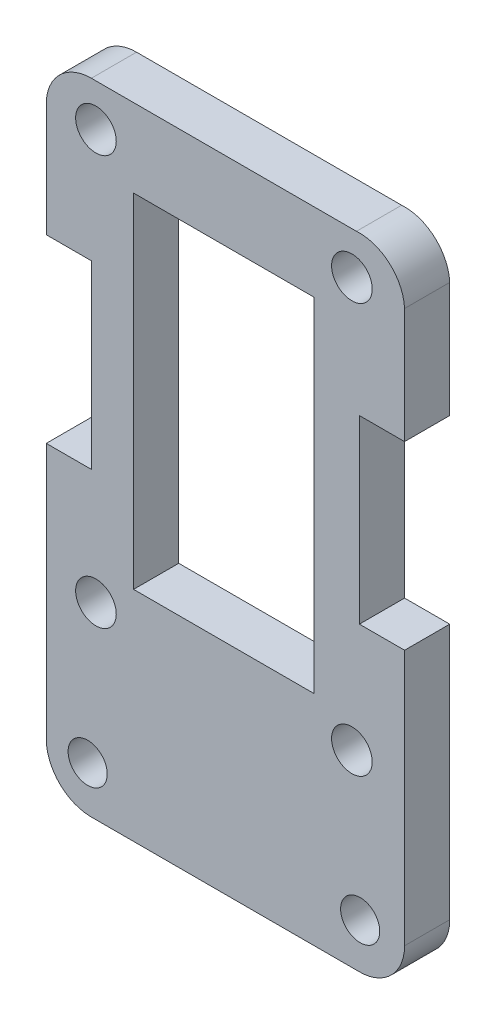
ISO-10303-21;
HEADER;
FILE_DESCRIPTION(('STEP AP214'),'2;1');
FILE_NAME('part.step','',(''),(''),'','','');
FILE_SCHEMA(('AUTOMOTIVE_DESIGN { 1 0 10303 214 1 1 1 1 }'));
ENDSEC;
DATA;
#1=APPLICATION_CONTEXT('core data for automotive mechanical design processes');
#2=APPLICATION_PROTOCOL_DEFINITION('international standard','automotive_design',2000,#1);
#3=PRODUCT_CONTEXT('',#1,'mechanical');
#4=PRODUCT('Part','Part','',(#3));
#5=PRODUCT_RELATED_PRODUCT_CATEGORY('part','',(#4));
#6=PRODUCT_DEFINITION_FORMATION('','',#4);
#7=PRODUCT_DEFINITION_CONTEXT('part definition',#1,'design');
#8=PRODUCT_DEFINITION('design','',#6,#7);
#9=PRODUCT_DEFINITION_SHAPE('','',#8);
#10=(LENGTH_UNIT() NAMED_UNIT(*) SI_UNIT(.MILLI.,.METRE.));
#11=(NAMED_UNIT(*) PLANE_ANGLE_UNIT() SI_UNIT($,.RADIAN.));
#12=(NAMED_UNIT(*) SI_UNIT($,.STERADIAN.) SOLID_ANGLE_UNIT());
#13=UNCERTAINTY_MEASURE_WITH_UNIT(LENGTH_MEASURE(1.E-05),#10,'distance_accuracy_value','');
#14=(GEOMETRIC_REPRESENTATION_CONTEXT(3) GLOBAL_UNCERTAINTY_ASSIGNED_CONTEXT((#13)) GLOBAL_UNIT_ASSIGNED_CONTEXT((#10,
#11,#12)) REPRESENTATION_CONTEXT('',''));
#15=CARTESIAN_POINT('',(0.,0.,0.));
#16=DIRECTION('',(0.,0.,1.));
#17=DIRECTION('',(1.,0.,0.));
#18=AXIS2_PLACEMENT_3D('',#15,#16,#17);
#19=CARTESIAN_POINT('',(58.6723620529699,60.5131167079834,3.));
#20=DIRECTION('',(0.,0.,1.));
#21=DIRECTION('',(1.,0.,0.));
#22=AXIS2_PLACEMENT_3D('',#19,#20,#21);
#23=PLANE('',#22);
#24=CARTESIAN_POINT('',(40.6173019415378,24.0039718277045,3.));
#25=DIRECTION('',(0.,0.,1.));
#26=DIRECTION('',(1.,0.,0.));
#27=AXIS2_PLACEMENT_3D('',#24,#25,#26);
#28=CIRCLE('',#27,1.30010409029223);
#29=CARTESIAN_POINT('',(41.91740603183,24.0039718277045,3.));
#30=VERTEX_POINT('',#29);
#31=EDGE_CURVE('E213',#30,#30,#28,.T.);
#32=ORIENTED_EDGE('',*,*,#31,.F.);
#33=EDGE_LOOP('',(#32));
#34=FACE_BOUND('',#33,.T.);
#35=CARTESIAN_POINT('',(41.1672459750652,33.5047324908659,3.));
#36=DIRECTION('',(0.,0.,1.));
#37=DIRECTION('',(1.,0.,0.));
#38=AXIS2_PLACEMENT_3D('',#35,#36,#37);
#39=CIRCLE('',#38,1.35010809376501);
#40=CARTESIAN_POINT('',(42.5173540688302,33.5047324908659,3.));
#41=VERTEX_POINT('',#40);
#42=EDGE_CURVE('E225',#41,#41,#39,.T.);
#43=ORIENTED_EDGE('',*,*,#42,.F.);
#44=EDGE_LOOP('',(#43));
#45=FACE_BOUND('',#44,.T.);
#46=CARTESIAN_POINT('',(41.1672459750652,60.7069103800571,3.));
#47=DIRECTION('',(0.,0.,1.));
#48=DIRECTION('',(1.,0.,0.));
#49=AXIS2_PLACEMENT_3D('',#46,#47,#48);
#50=CIRCLE('',#49,1.35010809376501);
#51=CARTESIAN_POINT('',(42.5173540688302,60.7069103800571,3.));
#52=VERTEX_POINT('',#51);
#53=EDGE_CURVE('E237',#52,#52,#50,.T.);
#54=ORIENTED_EDGE('',*,*,#53,.F.);
#55=EDGE_LOOP('',(#54));
#56=FACE_BOUND('',#55,.T.);
#57=CARTESIAN_POINT('',(58.6723620529699,60.5131167079834,3.));
#58=DIRECTION('',(0.,0.,1.));
#59=DIRECTION('',(1.,0.,0.));
#60=AXIS2_PLACEMENT_3D('',#57,#58,#59);
#61=CIRCLE('',#60,3.00012950662675);
#62=CARTESIAN_POINT('',(61.6686971945409,60.6639569410741,3.));
#63=VERTEX_POINT('',#62);
#64=CARTESIAN_POINT('',(58.4724383861315,63.5065775117973,3.));
#65=VERTEX_POINT('',#64);
#66=EDGE_CURVE('E243',#63,#65,#61,.T.);
#67=ORIENTED_EDGE('',*,*,#66,.T.);
#68=DIRECTION('',(-1.,0.,0.));
#69=VECTOR('',#68,1.);
#70=CARTESIAN_POINT('',(40.8627941372652,63.5065775117973,3.));
#71=LINE('',#70,#69);
#72=CARTESIAN_POINT('',(40.8627941372652,63.5065775117973,3.));
#73=VERTEX_POINT('',#72);
#74=EDGE_CURVE('E246',#65,#73,#71,.T.);
#75=ORIENTED_EDGE('',*,*,#74,.T.);
#76=CARTESIAN_POINT('',(40.8627941372613,60.5064480051708,3.));
#77=DIRECTION('',(0.,0.,1.));
#78=DIRECTION('',(1.,0.,0.));
#79=AXIS2_PLACEMENT_3D('',#76,#77,#78);
#80=CIRCLE('',#79,3.00012950662654);
#81=CARTESIAN_POINT('',(37.8667755346662,60.6634498823416,3.));
#82=VERTEX_POINT('',#81);
#83=EDGE_CURVE('E249',#73,#82,#80,.T.);
#84=ORIENTED_EDGE('',*,*,#83,.T.);
#85=DIRECTION('',(0.,-1.,0.));
#86=VECTOR('',#85,1.);
#87=CARTESIAN_POINT('',(37.8667755346662,53.0047759490466,3.));
#88=LINE('',#87,#86);
#89=CARTESIAN_POINT('',(37.8667755346662,53.0047759490466,3.));
#90=VERTEX_POINT('',#89);
#91=EDGE_CURVE('E251',#82,#90,#88,.T.);
#92=ORIENTED_EDGE('',*,*,#91,.T.);
#93=DIRECTION('',(1.,0.,0.));
#94=VECTOR('',#93,1.);
#95=CARTESIAN_POINT('',(37.8667755346662,53.0047759490466,3.));
#96=LINE('',#95,#94);
#97=CARTESIAN_POINT('',(40.8670157430328,53.0047759490466,3.));
#98=VERTEX_POINT('',#97);
#99=EDGE_CURVE('E253',#90,#98,#96,.T.);
#100=ORIENTED_EDGE('',*,*,#99,.T.);
#101=DIRECTION('',(0.,-1.,0.));
#102=VECTOR('',#101,1.);
#103=CARTESIAN_POINT('',(40.8670157430328,53.0047759490466,3.));
#104=LINE('',#103,#102);
#105=CARTESIAN_POINT('',(40.8670157430328,41.0047759490469,3.));
#106=VERTEX_POINT('',#105);
#107=EDGE_CURVE('E255',#98,#106,#104,.T.);
#108=ORIENTED_EDGE('',*,*,#107,.T.);
#109=DIRECTION('',(-1.,0.,0.));
#110=VECTOR('',#109,1.);
#111=CARTESIAN_POINT('',(40.8670157430328,41.0047759490469,3.));
#112=LINE('',#111,#110);
#113=CARTESIAN_POINT('',(37.8667755346662,41.0047759490469,3.));
#114=VERTEX_POINT('',#113);
#115=EDGE_CURVE('E257',#106,#114,#112,.T.);
#116=ORIENTED_EDGE('',*,*,#115,.T.);
#117=DIRECTION('',(0.,-1.,0.));
#118=VECTOR('',#117,1.);
#119=CARTESIAN_POINT('',(37.8667755346662,41.0047759490469,3.));
#120=LINE('',#119,#118);
#121=CARTESIAN_POINT('',(37.8667755346662,24.0034147683111,3.));
#122=VERTEX_POINT('',#121);
#123=EDGE_CURVE('E259',#114,#122,#120,.T.);
#124=ORIENTED_EDGE('',*,*,#123,.T.);
#125=CARTESIAN_POINT('',(40.8670851997447,24.003484225014,3.));
#126=DIRECTION('',(0.,0.,1.));
#127=DIRECTION('',(1.,0.,0.));
#128=AXIS2_PLACEMENT_3D('',#125,#126,#127);
#129=CIRCLE('',#128,3.00030966588246);
#130=CARTESIAN_POINT('',(40.7670519528112,21.0048426257735,3.));
#131=VERTEX_POINT('',#130);
#132=EDGE_CURVE('E261',#122,#131,#129,.T.);
#133=ORIENTED_EDGE('',*,*,#132,.T.);
#134=DIRECTION('',(1.,0.,0.));
#135=VECTOR('',#134,1.);
#136=CARTESIAN_POINT('',(40.7670519528112,21.0048426257735,3.));
#137=LINE('',#136,#135);
#138=CARTESIAN_POINT('',(58.5681805705856,21.0048426257735,3.));
#139=VERTEX_POINT('',#138);
#140=EDGE_CURVE('E263',#131,#139,#137,.T.);
#141=ORIENTED_EDGE('',*,*,#140,.T.);
#142=CARTESIAN_POINT('',(58.6682167848662,24.003654976669,3.));
#143=DIRECTION('',(0.,0.,1.));
#144=DIRECTION('',(1.,0.,0.));
#145=AXIS2_PLACEMENT_3D('',#142,#143,#144);
#146=CIRCLE('',#145,3.00048042154096);
#147=CARTESIAN_POINT('',(61.6686971945409,24.0039218270347,3.));
#148=VERTEX_POINT('',#147);
#149=EDGE_CURVE('E265',#139,#148,#146,.T.);
#150=ORIENTED_EDGE('',*,*,#149,.T.);
#151=DIRECTION('',(0.,1.,0.));
#152=VECTOR('',#151,1.);
#153=CARTESIAN_POINT('',(61.6686971945409,24.0039218270347,3.));
#154=LINE('',#153,#152);
#155=CARTESIAN_POINT('',(61.6686971945409,41.0047759490469,3.));
#156=VERTEX_POINT('',#155);
#157=EDGE_CURVE('E267',#148,#156,#154,.T.);
#158=ORIENTED_EDGE('',*,*,#157,.T.);
#159=DIRECTION('',(-1.,0.,0.));
#160=VECTOR('',#159,1.);
#161=CARTESIAN_POINT('',(58.6686971945409,41.0047759490469,3.));
#162=LINE('',#161,#160);
#163=CARTESIAN_POINT('',(58.6686971945409,41.0047759490469,3.));
#164=VERTEX_POINT('',#163);
#165=EDGE_CURVE('E269',#156,#164,#162,.T.);
#166=ORIENTED_EDGE('',*,*,#165,.T.);
#167=DIRECTION('',(0.,1.,0.));
#168=VECTOR('',#167,1.);
#169=CARTESIAN_POINT('',(58.6686971945409,53.0047759490466,3.));
#170=LINE('',#169,#168);
#171=CARTESIAN_POINT('',(58.6686971945409,53.0047759490466,3.));
#172=VERTEX_POINT('',#171);
#173=EDGE_CURVE('E271',#164,#172,#170,.T.);
#174=ORIENTED_EDGE('',*,*,#173,.T.);
#175=DIRECTION('',(1.,0.,0.));
#176=VECTOR('',#175,1.);
#177=CARTESIAN_POINT('',(61.6686971945409,53.0047759490466,3.));
#178=LINE('',#177,#176);
#179=CARTESIAN_POINT('',(61.6686971945409,53.0047759490466,3.));
#180=VERTEX_POINT('',#179);
#181=EDGE_CURVE('E273',#172,#180,#178,.T.);
#182=ORIENTED_EDGE('',*,*,#181,.T.);
#183=DIRECTION('',(0.,1.,0.));
#184=VECTOR('',#183,1.);
#185=CARTESIAN_POINT('',(61.6686971945409,53.0047759490466,3.));
#186=LINE('',#185,#184);
#187=EDGE_CURVE('E275',#180,#63,#186,.T.);
#188=ORIENTED_EDGE('',*,*,#187,.T.);
#189=EDGE_LOOP('',(#67,#75,#84,#92,#100,#108,#116,#124,#133,#141,#150,#158,#166,#174,#182,#188));
#190=FACE_BOUND('',#189,.T.);
#191=CARTESIAN_POINT('',(58.1686071558098,60.7069103800571,3.));
#192=DIRECTION('',(0.,0.,1.));
#193=DIRECTION('',(1.,0.,0.));
#194=AXIS2_PLACEMENT_3D('',#191,#192,#193);
#195=CIRCLE('',#194,1.35010809376501);
#196=CARTESIAN_POINT('',(59.5187152495748,60.7069103800571,3.));
#197=VERTEX_POINT('',#196);
#198=EDGE_CURVE('E231',#197,#197,#195,.T.);
#199=ORIENTED_EDGE('',*,*,#198,.F.);
#200=EDGE_LOOP('',(#199));
#201=FACE_BOUND('',#200,.T.);
#202=CARTESIAN_POINT('',(58.1686071558097,33.5047324908659,3.));
#203=DIRECTION('',(0.,0.,1.));
#204=DIRECTION('',(1.,0.,0.));
#205=AXIS2_PLACEMENT_3D('',#202,#203,#204);
#206=CIRCLE('',#205,1.35010809376501);
#207=CARTESIAN_POINT('',(59.5187152495747,33.5047324908659,3.));
#208=VERTEX_POINT('',#207);
#209=EDGE_CURVE('E219',#208,#208,#206,.T.);
#210=ORIENTED_EDGE('',*,*,#209,.F.);
#211=EDGE_LOOP('',(#210));
#212=FACE_BOUND('',#211,.T.);
#213=CARTESIAN_POINT('',(58.7187511986834,24.0039718277045,3.));
#214=DIRECTION('',(0.,0.,1.));
#215=DIRECTION('',(1.,0.,0.));
#216=AXIS2_PLACEMENT_3D('',#213,#214,#215);
#217=CIRCLE('',#216,1.30010409029223);
#218=CARTESIAN_POINT('',(60.0188552889756,24.0039718277045,3.));
#219=VERTEX_POINT('',#218);
#220=EDGE_CURVE('E207',#219,#219,#217,.T.);
#221=ORIENTED_EDGE('',*,*,#220,.F.);
#222=EDGE_LOOP('',(#221));
#223=FACE_BOUND('',#222,.T.);
#224=DIRECTION('',(0.,-1.,0.));
#225=VECTOR('',#224,1.);
#226=CARTESIAN_POINT('',(43.667135844965,58.3048426257735,3.));
#227=LINE('',#226,#225);
#228=CARTESIAN_POINT('',(43.667135844965,58.3048426257735,3.));
#229=VERTEX_POINT('',#228);
#230=CARTESIAN_POINT('',(43.667135844965,35.5048426257735,3.));
#231=VERTEX_POINT('',#230);
#232=EDGE_CURVE('E179',#229,#231,#227,.T.);
#233=ORIENTED_EDGE('',*,*,#232,.F.);
#234=DIRECTION('',(-1.,0.,0.));
#235=VECTOR('',#234,1.);
#236=CARTESIAN_POINT('',(55.6680966784318,58.3048426257735,3.));
#237=LINE('',#236,#235);
#238=CARTESIAN_POINT('',(55.6680966784318,58.3048426257735,3.));
#239=VERTEX_POINT('',#238);
#240=EDGE_CURVE('E171',#239,#229,#237,.T.);
#241=ORIENTED_EDGE('',*,*,#240,.F.);
#242=DIRECTION('',(0.,1.,0.));
#243=VECTOR('',#242,1.);
#244=CARTESIAN_POINT('',(55.6680966784318,58.3048426257735,3.));
#245=LINE('',#244,#243);
#246=CARTESIAN_POINT('',(55.6680966784318,35.5048426257735,3.));
#247=VERTEX_POINT('',#246);
#248=EDGE_CURVE('E193',#247,#239,#245,.T.);
#249=ORIENTED_EDGE('',*,*,#248,.F.);
#250=DIRECTION('',(1.,0.,0.));
#251=VECTOR('',#250,1.);
#252=CARTESIAN_POINT('',(43.667135844965,35.5048426257735,3.));
#253=LINE('',#252,#251);
#254=EDGE_CURVE('E191',#231,#247,#253,.T.);
#255=ORIENTED_EDGE('',*,*,#254,.F.);
#256=EDGE_LOOP('',(#233,#241,#249,#255));
#257=FACE_BOUND('',#256,.T.);
#258=ADVANCED_FACE('F34',(#34,#45,#56,#190,#201,#212,#223,#257),#23,.T.);
#259=CARTESIAN_POINT('',(58.6723620529699,60.5131167079834,0.));
#260=DIRECTION('',(0.,0.,1.));
#261=DIRECTION('',(1.,0.,0.));
#262=AXIS2_PLACEMENT_3D('',#259,#260,#261);
#263=PLANE('',#262);
#264=CARTESIAN_POINT('',(58.7187511986834,24.0039718277045,0.));
#265=DIRECTION('',(0.,0.,1.));
#266=DIRECTION('',(1.,0.,0.));
#267=AXIS2_PLACEMENT_3D('',#264,#265,#266);
#268=CIRCLE('',#267,1.30010409029223);
#269=CARTESIAN_POINT('',(60.0188552889756,24.0039718277045,0.));
#270=VERTEX_POINT('',#269);
#271=EDGE_CURVE('E187',#270,#270,#268,.T.);
#272=ORIENTED_EDGE('',*,*,#271,.T.);
#273=EDGE_LOOP('',(#272));
#274=FACE_BOUND('',#273,.T.);
#275=CARTESIAN_POINT('',(40.6173019415378,24.0039718277045,0.));
#276=DIRECTION('',(0.,0.,1.));
#277=DIRECTION('',(1.,0.,0.));
#278=AXIS2_PLACEMENT_3D('',#275,#276,#277);
#279=CIRCLE('',#278,1.30010409029223);
#280=CARTESIAN_POINT('',(41.91740603183,24.0039718277045,0.));
#281=VERTEX_POINT('',#280);
#282=EDGE_CURVE('E210',#281,#281,#279,.T.);
#283=ORIENTED_EDGE('',*,*,#282,.T.);
#284=EDGE_LOOP('',(#283));
#285=FACE_BOUND('',#284,.T.);
#286=CARTESIAN_POINT('',(58.1686071558097,33.5047324908659,0.));
#287=DIRECTION('',(0.,0.,1.));
#288=DIRECTION('',(1.,0.,0.));
#289=AXIS2_PLACEMENT_3D('',#286,#287,#288);
#290=CIRCLE('',#289,1.35010809376501);
#291=CARTESIAN_POINT('',(59.5187152495747,33.5047324908659,0.));
#292=VERTEX_POINT('',#291);
#293=EDGE_CURVE('E216',#292,#292,#290,.T.);
#294=ORIENTED_EDGE('',*,*,#293,.T.);
#295=EDGE_LOOP('',(#294));
#296=FACE_BOUND('',#295,.T.);
#297=CARTESIAN_POINT('',(41.1672459750652,33.5047324908659,0.));
#298=DIRECTION('',(0.,0.,1.));
#299=DIRECTION('',(1.,0.,0.));
#300=AXIS2_PLACEMENT_3D('',#297,#298,#299);
#301=CIRCLE('',#300,1.35010809376501);
#302=CARTESIAN_POINT('',(42.5173540688302,33.5047324908659,0.));
#303=VERTEX_POINT('',#302);
#304=EDGE_CURVE('E222',#303,#303,#301,.T.);
#305=ORIENTED_EDGE('',*,*,#304,.T.);
#306=EDGE_LOOP('',(#305));
#307=FACE_BOUND('',#306,.T.);
#308=CARTESIAN_POINT('',(58.1686071558098,60.7069103800571,0.));
#309=DIRECTION('',(0.,0.,1.));
#310=DIRECTION('',(1.,0.,0.));
#311=AXIS2_PLACEMENT_3D('',#308,#309,#310);
#312=CIRCLE('',#311,1.35010809376501);
#313=CARTESIAN_POINT('',(59.5187152495748,60.7069103800571,0.));
#314=VERTEX_POINT('',#313);
#315=EDGE_CURVE('E228',#314,#314,#312,.T.);
#316=ORIENTED_EDGE('',*,*,#315,.T.);
#317=EDGE_LOOP('',(#316));
#318=FACE_BOUND('',#317,.T.);
#319=CARTESIAN_POINT('',(41.1672459750652,60.7069103800571,0.));
#320=DIRECTION('',(0.,0.,1.));
#321=DIRECTION('',(1.,0.,0.));
#322=AXIS2_PLACEMENT_3D('',#319,#320,#321);
#323=CIRCLE('',#322,1.35010809376501);
#324=CARTESIAN_POINT('',(42.5173540688302,60.7069103800571,0.));
#325=VERTEX_POINT('',#324);
#326=EDGE_CURVE('E234',#325,#325,#323,.T.);
#327=ORIENTED_EDGE('',*,*,#326,.T.);
#328=EDGE_LOOP('',(#327));
#329=FACE_BOUND('',#328,.T.);
#330=CARTESIAN_POINT('',(58.6723620529699,60.5131167079834,0.));
#331=DIRECTION('',(0.,0.,1.));
#332=DIRECTION('',(1.,0.,0.));
#333=AXIS2_PLACEMENT_3D('',#330,#331,#332);
#334=CIRCLE('',#333,3.00012950662675);
#335=CARTESIAN_POINT('',(61.6686971945409,60.6639569410741,0.));
#336=VERTEX_POINT('',#335);
#337=CARTESIAN_POINT('',(58.4724383861315,63.5065775117973,0.));
#338=VERTEX_POINT('',#337);
#339=EDGE_CURVE('E240',#336,#338,#334,.T.);
#340=ORIENTED_EDGE('',*,*,#339,.F.);
#341=DIRECTION('',(0.,1.,0.));
#342=VECTOR('',#341,1.);
#343=CARTESIAN_POINT('',(61.6686971945409,53.0047759490466,0.));
#344=LINE('',#343,#342);
#345=CARTESIAN_POINT('',(61.6686971945409,53.0047759490466,0.));
#346=VERTEX_POINT('',#345);
#347=EDGE_CURVE('E247',#346,#336,#344,.T.);
#348=ORIENTED_EDGE('',*,*,#347,.F.);
#349=DIRECTION('',(1.,0.,0.));
#350=VECTOR('',#349,1.);
#351=CARTESIAN_POINT('',(61.6686971945409,53.0047759490466,0.));
#352=LINE('',#351,#350);
#353=CARTESIAN_POINT('',(58.6686971945409,53.0047759490466,0.));
#354=VERTEX_POINT('',#353);
#355=EDGE_CURVE('E306',#354,#346,#352,.T.);
#356=ORIENTED_EDGE('',*,*,#355,.F.);
#357=DIRECTION('',(0.,1.,0.));
#358=VECTOR('',#357,1.);
#359=CARTESIAN_POINT('',(58.6686971945409,53.0047759490466,0.));
#360=LINE('',#359,#358);
#361=CARTESIAN_POINT('',(58.6686971945409,41.0047759490469,0.));
#362=VERTEX_POINT('',#361);
#363=EDGE_CURVE('E304',#362,#354,#360,.T.);
#364=ORIENTED_EDGE('',*,*,#363,.F.);
#365=DIRECTION('',(-1.,0.,0.));
#366=VECTOR('',#365,1.);
#367=CARTESIAN_POINT('',(58.6686971945409,41.0047759490469,0.));
#368=LINE('',#367,#366);
#369=CARTESIAN_POINT('',(61.6686971945409,41.0047759490469,0.));
#370=VERTEX_POINT('',#369);
#371=EDGE_CURVE('E302',#370,#362,#368,.T.);
#372=ORIENTED_EDGE('',*,*,#371,.F.);
#373=DIRECTION('',(0.,1.,0.));
#374=VECTOR('',#373,1.);
#375=CARTESIAN_POINT('',(61.6686971945409,24.0039218270347,0.));
#376=LINE('',#375,#374);
#377=CARTESIAN_POINT('',(61.6686971945409,24.0039218270347,0.));
#378=VERTEX_POINT('',#377);
#379=EDGE_CURVE('E300',#378,#370,#376,.T.);
#380=ORIENTED_EDGE('',*,*,#379,.F.);
#381=CARTESIAN_POINT('',(58.6682167848662,24.003654976669,0.));
#382=DIRECTION('',(0.,0.,1.));
#383=DIRECTION('',(1.,0.,0.));
#384=AXIS2_PLACEMENT_3D('',#381,#382,#383);
#385=CIRCLE('',#384,3.00048042154096);
#386=CARTESIAN_POINT('',(58.5681805705856,21.0048426257735,0.));
#387=VERTEX_POINT('',#386);
#388=EDGE_CURVE('E298',#387,#378,#385,.T.);
#389=ORIENTED_EDGE('',*,*,#388,.F.);
#390=DIRECTION('',(1.,0.,0.));
#391=VECTOR('',#390,1.);
#392=CARTESIAN_POINT('',(40.7670519528112,21.0048426257735,0.));
#393=LINE('',#392,#391);
#394=CARTESIAN_POINT('',(40.7670519528112,21.0048426257735,0.));
#395=VERTEX_POINT('',#394);
#396=EDGE_CURVE('E296',#395,#387,#393,.T.);
#397=ORIENTED_EDGE('',*,*,#396,.F.);
#398=CARTESIAN_POINT('',(40.8670851997447,24.003484225014,0.));
#399=DIRECTION('',(0.,0.,1.));
#400=DIRECTION('',(1.,0.,0.));
#401=AXIS2_PLACEMENT_3D('',#398,#399,#400);
#402=CIRCLE('',#401,3.00030966588246);
#403=CARTESIAN_POINT('',(37.8667755346662,24.0034147683111,0.));
#404=VERTEX_POINT('',#403);
#405=EDGE_CURVE('E294',#404,#395,#402,.T.);
#406=ORIENTED_EDGE('',*,*,#405,.F.);
#407=DIRECTION('',(0.,-1.,0.));
#408=VECTOR('',#407,1.);
#409=CARTESIAN_POINT('',(37.8667755346662,41.0047759490469,0.));
#410=LINE('',#409,#408);
#411=CARTESIAN_POINT('',(37.8667755346662,41.0047759490469,0.));
#412=VERTEX_POINT('',#411);
#413=EDGE_CURVE('E292',#412,#404,#410,.T.);
#414=ORIENTED_EDGE('',*,*,#413,.F.);
#415=DIRECTION('',(-1.,0.,0.));
#416=VECTOR('',#415,1.);
#417=CARTESIAN_POINT('',(40.8670157430328,41.0047759490469,0.));
#418=LINE('',#417,#416);
#419=CARTESIAN_POINT('',(40.8670157430328,41.0047759490469,0.));
#420=VERTEX_POINT('',#419);
#421=EDGE_CURVE('E290',#420,#412,#418,.T.);
#422=ORIENTED_EDGE('',*,*,#421,.F.);
#423=DIRECTION('',(0.,-1.,0.));
#424=VECTOR('',#423,1.);
#425=CARTESIAN_POINT('',(40.8670157430328,53.0047759490466,0.));
#426=LINE('',#425,#424);
#427=CARTESIAN_POINT('',(40.8670157430328,53.0047759490466,0.));
#428=VERTEX_POINT('',#427);
#429=EDGE_CURVE('E288',#428,#420,#426,.T.);
#430=ORIENTED_EDGE('',*,*,#429,.F.);
#431=DIRECTION('',(1.,0.,0.));
#432=VECTOR('',#431,1.);
#433=CARTESIAN_POINT('',(37.8667755346662,53.0047759490466,0.));
#434=LINE('',#433,#432);
#435=CARTESIAN_POINT('',(37.8667755346662,53.0047759490466,0.));
#436=VERTEX_POINT('',#435);
#437=EDGE_CURVE('E286',#436,#428,#434,.T.);
#438=ORIENTED_EDGE('',*,*,#437,.F.);
#439=DIRECTION('',(0.,-1.,0.));
#440=VECTOR('',#439,1.);
#441=CARTESIAN_POINT('',(37.8667755346662,53.0047759490466,0.));
#442=LINE('',#441,#440);
#443=CARTESIAN_POINT('',(37.8667755346662,60.6634498823416,0.));
#444=VERTEX_POINT('',#443);
#445=EDGE_CURVE('E284',#444,#436,#442,.T.);
#446=ORIENTED_EDGE('',*,*,#445,.F.);
#447=CARTESIAN_POINT('',(40.8627941372613,60.5064480051708,0.));
#448=DIRECTION('',(0.,0.,1.));
#449=DIRECTION('',(1.,0.,0.));
#450=AXIS2_PLACEMENT_3D('',#447,#448,#449);
#451=CIRCLE('',#450,3.00012950662654);
#452=CARTESIAN_POINT('',(40.8627941372652,63.5065775117973,0.));
#453=VERTEX_POINT('',#452);
#454=EDGE_CURVE('E282',#453,#444,#451,.T.);
#455=ORIENTED_EDGE('',*,*,#454,.F.);
#456=DIRECTION('',(-1.,0.,0.));
#457=VECTOR('',#456,1.);
#458=CARTESIAN_POINT('',(40.8627941372652,63.5065775117973,0.));
#459=LINE('',#458,#457);
#460=EDGE_CURVE('E280',#338,#453,#459,.T.);
#461=ORIENTED_EDGE('',*,*,#460,.F.);
#462=EDGE_LOOP('',(#340,#348,#356,#364,#372,#380,#389,#397,#406,#414,#422,#430,#438,#446,#455,#461));
#463=FACE_BOUND('',#462,.T.);
#464=DIRECTION('',(-1.,0.,0.));
#465=VECTOR('',#464,1.);
#466=CARTESIAN_POINT('',(55.6680966784318,58.3048426257735,0.));
#467=LINE('',#466,#465);
#468=CARTESIAN_POINT('',(55.6680966784318,58.3048426257735,0.));
#469=VERTEX_POINT('',#468);
#470=CARTESIAN_POINT('',(43.667135844965,58.3048426257735,0.));
#471=VERTEX_POINT('',#470);
#472=EDGE_CURVE('E57',#469,#471,#467,.T.);
#473=ORIENTED_EDGE('',*,*,#472,.T.);
#474=DIRECTION('',(0.,-1.,0.));
#475=VECTOR('',#474,1.);
#476=CARTESIAN_POINT('',(43.667135844965,58.3048426257735,0.));
#477=LINE('',#476,#475);
#478=CARTESIAN_POINT('',(43.667135844965,35.5048426257735,0.));
#479=VERTEX_POINT('',#478);
#480=EDGE_CURVE('E186',#471,#479,#477,.T.);
#481=ORIENTED_EDGE('',*,*,#480,.T.);
#482=DIRECTION('',(1.,0.,0.));
#483=VECTOR('',#482,1.);
#484=CARTESIAN_POINT('',(43.667135844965,35.5048426257735,0.));
#485=LINE('',#484,#483);
#486=CARTESIAN_POINT('',(55.6680966784318,35.5048426257735,0.));
#487=VERTEX_POINT('',#486);
#488=EDGE_CURVE('E199',#479,#487,#485,.T.);
#489=ORIENTED_EDGE('',*,*,#488,.T.);
#490=DIRECTION('',(0.,1.,0.));
#491=VECTOR('',#490,1.);
#492=CARTESIAN_POINT('',(55.6680966784318,58.3048426257735,0.));
#493=LINE('',#492,#491);
#494=EDGE_CURVE('E180',#487,#469,#493,.T.);
#495=ORIENTED_EDGE('',*,*,#494,.T.);
#496=EDGE_LOOP('',(#473,#481,#489,#495));
#497=FACE_BOUND('',#496,.T.);
#498=ADVANCED_FACE('F360',(#274,#285,#296,#307,#318,#329,#463,#497),#263,.F.);
#499=CARTESIAN_POINT('',(58.6723620529699,60.5131167079834,3.));
#500=DIRECTION('',(0.,0.,-1.));
#501=DIRECTION('',(-1.,0.,0.));
#502=AXIS2_PLACEMENT_3D('',#499,#500,#501);
#503=CYLINDRICAL_SURFACE('',#502,3.00012950662675);
#504=ORIENTED_EDGE('',*,*,#339,.T.);
#505=DIRECTION('',(0.,0.,-1.));
#506=VECTOR('',#505,1.);
#507=CARTESIAN_POINT('',(58.4724383861315,63.5065775117973,3.));
#508=LINE('',#507,#506);
#509=EDGE_CURVE('E11',#65,#338,#508,.T.);
#510=ORIENTED_EDGE('',*,*,#509,.F.);
#511=ORIENTED_EDGE('',*,*,#66,.F.);
#512=DIRECTION('',(0.,0.,-1.));
#513=VECTOR('',#512,1.);
#514=CARTESIAN_POINT('',(61.6686971945409,60.6639569410741,3.));
#515=LINE('',#514,#513);
#516=EDGE_CURVE('E277',#63,#336,#515,.T.);
#517=ORIENTED_EDGE('',*,*,#516,.T.);
#518=EDGE_LOOP('',(#504,#510,#511,#517));
#519=FACE_BOUND('',#518,.T.);
#520=ADVANCED_FACE('F36',(#519),#503,.T.);
#521=CARTESIAN_POINT('',(40.8627941372652,63.5065775117973,3.));
#522=DIRECTION('',(0.,-1.,0.));
#523=DIRECTION('',(1.,0.,0.));
#524=AXIS2_PLACEMENT_3D('',#521,#522,#523);
#525=PLANE('',#524);
#526=ORIENTED_EDGE('',*,*,#460,.T.);
#527=DIRECTION('',(0.,0.,-1.));
#528=VECTOR('',#527,1.);
#529=CARTESIAN_POINT('',(40.8627941372652,63.5065775117973,3.));
#530=LINE('',#529,#528);
#531=EDGE_CURVE('E42',#73,#453,#530,.T.);
#532=ORIENTED_EDGE('',*,*,#531,.F.);
#533=ORIENTED_EDGE('',*,*,#74,.F.);
#534=ORIENTED_EDGE('',*,*,#509,.T.);
#535=EDGE_LOOP('',(#526,#532,#533,#534));
#536=FACE_BOUND('',#535,.T.);
#537=ADVANCED_FACE('F378',(#536),#525,.F.);
#538=CARTESIAN_POINT('',(40.8627941372613,60.5064480051708,3.));
#539=DIRECTION('',(0.,0.,-1.));
#540=DIRECTION('',(-1.,0.,0.));
#541=AXIS2_PLACEMENT_3D('',#538,#539,#540);
#542=CYLINDRICAL_SURFACE('',#541,3.00012950662654);
#543=ORIENTED_EDGE('',*,*,#454,.T.);
#544=DIRECTION('',(0.,0.,-1.));
#545=VECTOR('',#544,1.);
#546=CARTESIAN_POINT('',(37.8667755346662,60.6634498823416,3.));
#547=LINE('',#546,#545);
#548=EDGE_CURVE('E347',#82,#444,#547,.T.);
#549=ORIENTED_EDGE('',*,*,#548,.F.);
#550=ORIENTED_EDGE('',*,*,#83,.F.);
#551=ORIENTED_EDGE('',*,*,#531,.T.);
#552=EDGE_LOOP('',(#543,#549,#550,#551));
#553=FACE_BOUND('',#552,.T.);
#554=ADVANCED_FACE('F354',(#553),#542,.T.);
#555=CARTESIAN_POINT('',(37.8667755346662,53.0047759490466,3.));
#556=DIRECTION('',(1.,0.,0.));
#557=DIRECTION('',(0.,0.,-1.));
#558=AXIS2_PLACEMENT_3D('',#555,#556,#557);
#559=PLANE('',#558);
#560=ORIENTED_EDGE('',*,*,#445,.T.);
#561=DIRECTION('',(0.,0.,-1.));
#562=VECTOR('',#561,1.);
#563=CARTESIAN_POINT('',(37.8667755346662,53.0047759490466,3.));
#564=LINE('',#563,#562);
#565=EDGE_CURVE('E344',#90,#436,#564,.T.);
#566=ORIENTED_EDGE('',*,*,#565,.F.);
#567=ORIENTED_EDGE('',*,*,#91,.F.);
#568=ORIENTED_EDGE('',*,*,#548,.T.);
#569=EDGE_LOOP('',(#560,#566,#567,#568));
#570=FACE_BOUND('',#569,.T.);
#571=ADVANCED_FACE('F366',(#570),#559,.F.);
#572=CARTESIAN_POINT('',(37.8667755346662,53.0047759490466,3.));
#573=DIRECTION('',(0.,1.,0.));
#574=DIRECTION('',(0.,0.,1.));
#575=AXIS2_PLACEMENT_3D('',#572,#573,#574);
#576=PLANE('',#575);
#577=ORIENTED_EDGE('',*,*,#437,.T.);
#578=DIRECTION('',(0.,0.,-1.));
#579=VECTOR('',#578,1.);
#580=CARTESIAN_POINT('',(40.8670157430328,53.0047759490466,3.));
#581=LINE('',#580,#579);
#582=EDGE_CURVE('E341',#98,#428,#581,.T.);
#583=ORIENTED_EDGE('',*,*,#582,.F.);
#584=ORIENTED_EDGE('',*,*,#99,.F.);
#585=ORIENTED_EDGE('',*,*,#565,.T.);
#586=EDGE_LOOP('',(#577,#583,#584,#585));
#587=FACE_BOUND('',#586,.T.);
#588=ADVANCED_FACE('F370',(#587),#576,.F.);
#589=CARTESIAN_POINT('',(40.8670157430328,53.0047759490466,3.));
#590=DIRECTION('',(1.,0.,0.));
#591=DIRECTION('',(0.,0.,-1.));
#592=AXIS2_PLACEMENT_3D('',#589,#590,#591);
#593=PLANE('',#592);
#594=ORIENTED_EDGE('',*,*,#429,.T.);
#595=DIRECTION('',(0.,0.,-1.));
#596=VECTOR('',#595,1.);
#597=CARTESIAN_POINT('',(40.8670157430328,41.0047759490469,3.));
#598=LINE('',#597,#596);
#599=EDGE_CURVE('E338',#106,#420,#598,.T.);
#600=ORIENTED_EDGE('',*,*,#599,.F.);
#601=ORIENTED_EDGE('',*,*,#107,.F.);
#602=ORIENTED_EDGE('',*,*,#582,.T.);
#603=EDGE_LOOP('',(#594,#600,#601,#602));
#604=FACE_BOUND('',#603,.T.);
#605=ADVANCED_FACE('F431',(#604),#593,.F.);
#606=CARTESIAN_POINT('',(40.8670157430328,41.0047759490469,3.));
#607=DIRECTION('',(0.,-1.,0.));
#608=DIRECTION('',(1.,0.,0.));
#609=AXIS2_PLACEMENT_3D('',#606,#607,#608);
#610=PLANE('',#609);
#611=ORIENTED_EDGE('',*,*,#421,.T.);
#612=DIRECTION('',(0.,0.,-1.));
#613=VECTOR('',#612,1.);
#614=CARTESIAN_POINT('',(37.8667755346662,41.0047759490469,3.));
#615=LINE('',#614,#613);
#616=EDGE_CURVE('E335',#114,#412,#615,.T.);
#617=ORIENTED_EDGE('',*,*,#616,.F.);
#618=ORIENTED_EDGE('',*,*,#115,.F.);
#619=ORIENTED_EDGE('',*,*,#599,.T.);
#620=EDGE_LOOP('',(#611,#617,#618,#619));
#621=FACE_BOUND('',#620,.T.);
#622=ADVANCED_FACE('F428',(#621),#610,.F.);
#623=CARTESIAN_POINT('',(37.8667755346662,41.0047759490469,3.));
#624=DIRECTION('',(1.,0.,0.));
#625=DIRECTION('',(0.,0.,-1.));
#626=AXIS2_PLACEMENT_3D('',#623,#624,#625);
#627=PLANE('',#626);
#628=ORIENTED_EDGE('',*,*,#413,.T.);
#629=DIRECTION('',(0.,0.,-1.));
#630=VECTOR('',#629,1.);
#631=CARTESIAN_POINT('',(37.8667755346662,24.0034147683111,3.));
#632=LINE('',#631,#630);
#633=EDGE_CURVE('E332',#122,#404,#632,.T.);
#634=ORIENTED_EDGE('',*,*,#633,.F.);
#635=ORIENTED_EDGE('',*,*,#123,.F.);
#636=ORIENTED_EDGE('',*,*,#616,.T.);
#637=EDGE_LOOP('',(#628,#634,#635,#636));
#638=FACE_BOUND('',#637,.T.);
#639=ADVANCED_FACE('F424',(#638),#627,.F.);
#640=CARTESIAN_POINT('',(40.8670851997447,24.003484225014,3.));
#641=DIRECTION('',(0.,0.,-1.));
#642=DIRECTION('',(-1.,0.,0.));
#643=AXIS2_PLACEMENT_3D('',#640,#641,#642);
#644=CYLINDRICAL_SURFACE('',#643,3.00030966588246);
#645=ORIENTED_EDGE('',*,*,#405,.T.);
#646=DIRECTION('',(0.,0.,-1.));
#647=VECTOR('',#646,1.);
#648=CARTESIAN_POINT('',(40.7670519528112,21.0048426257735,3.));
#649=LINE('',#648,#647);
#650=EDGE_CURVE('E329',#131,#395,#649,.T.);
#651=ORIENTED_EDGE('',*,*,#650,.F.);
#652=ORIENTED_EDGE('',*,*,#132,.F.);
#653=ORIENTED_EDGE('',*,*,#633,.T.);
#654=EDGE_LOOP('',(#645,#651,#652,#653));
#655=FACE_BOUND('',#654,.T.);
#656=ADVANCED_FACE('F420',(#655),#644,.T.);
#657=CARTESIAN_POINT('',(40.7670519528112,21.0048426257735,3.));
#658=DIRECTION('',(0.,1.,0.));
#659=DIRECTION('',(-1.,0.,0.));
#660=AXIS2_PLACEMENT_3D('',#657,#658,#659);
#661=PLANE('',#660);
#662=ORIENTED_EDGE('',*,*,#396,.T.);
#663=DIRECTION('',(0.,0.,-1.));
#664=VECTOR('',#663,1.);
#665=CARTESIAN_POINT('',(58.5681805705856,21.0048426257735,3.));
#666=LINE('',#665,#664);
#667=EDGE_CURVE('E326',#139,#387,#666,.T.);
#668=ORIENTED_EDGE('',*,*,#667,.F.);
#669=ORIENTED_EDGE('',*,*,#140,.F.);
#670=ORIENTED_EDGE('',*,*,#650,.T.);
#671=EDGE_LOOP('',(#662,#668,#669,#670));
#672=FACE_BOUND('',#671,.T.);
#673=ADVANCED_FACE('F415',(#672),#661,.F.);
#674=CARTESIAN_POINT('',(58.6682167848662,24.003654976669,3.));
#675=DIRECTION('',(0.,0.,-1.));
#676=DIRECTION('',(-1.,0.,0.));
#677=AXIS2_PLACEMENT_3D('',#674,#675,#676);
#678=CYLINDRICAL_SURFACE('',#677,3.00048042154096);
#679=ORIENTED_EDGE('',*,*,#388,.T.);
#680=DIRECTION('',(0.,0.,-1.));
#681=VECTOR('',#680,1.);
#682=CARTESIAN_POINT('',(61.6686971945409,24.0039218270347,3.));
#683=LINE('',#682,#681);
#684=EDGE_CURVE('E323',#148,#378,#683,.T.);
#685=ORIENTED_EDGE('',*,*,#684,.F.);
#686=ORIENTED_EDGE('',*,*,#149,.F.);
#687=ORIENTED_EDGE('',*,*,#667,.T.);
#688=EDGE_LOOP('',(#679,#685,#686,#687));
#689=FACE_BOUND('',#688,.T.);
#690=ADVANCED_FACE('F409',(#689),#678,.T.);
#691=CARTESIAN_POINT('',(61.6686971945409,24.0039218270347,3.));
#692=DIRECTION('',(-1.,0.,0.));
#693=DIRECTION('',(0.,0.,1.));
#694=AXIS2_PLACEMENT_3D('',#691,#692,#693);
#695=PLANE('',#694);
#696=ORIENTED_EDGE('',*,*,#379,.T.);
#697=DIRECTION('',(0.,0.,-1.));
#698=VECTOR('',#697,1.);
#699=CARTESIAN_POINT('',(61.6686971945409,41.0047759490469,3.));
#700=LINE('',#699,#698);
#701=EDGE_CURVE('E320',#156,#370,#700,.T.);
#702=ORIENTED_EDGE('',*,*,#701,.F.);
#703=ORIENTED_EDGE('',*,*,#157,.F.);
#704=ORIENTED_EDGE('',*,*,#684,.T.);
#705=EDGE_LOOP('',(#696,#702,#703,#704));
#706=FACE_BOUND('',#705,.T.);
#707=ADVANCED_FACE('F405',(#706),#695,.F.);
#708=CARTESIAN_POINT('',(58.6686971945409,41.0047759490469,3.));
#709=DIRECTION('',(0.,-1.,0.));
#710=DIRECTION('',(0.,0.,-1.));
#711=AXIS2_PLACEMENT_3D('',#708,#709,#710);
#712=PLANE('',#711);
#713=ORIENTED_EDGE('',*,*,#371,.T.);
#714=DIRECTION('',(0.,0.,-1.));
#715=VECTOR('',#714,1.);
#716=CARTESIAN_POINT('',(58.6686971945409,41.0047759490469,3.));
#717=LINE('',#716,#715);
#718=EDGE_CURVE('E317',#164,#362,#717,.T.);
#719=ORIENTED_EDGE('',*,*,#718,.F.);
#720=ORIENTED_EDGE('',*,*,#165,.F.);
#721=ORIENTED_EDGE('',*,*,#701,.T.);
#722=EDGE_LOOP('',(#713,#719,#720,#721));
#723=FACE_BOUND('',#722,.T.);
#724=ADVANCED_FACE('F400',(#723),#712,.F.);
#725=CARTESIAN_POINT('',(58.6686971945409,53.0047759490466,3.));
#726=DIRECTION('',(-1.,0.,0.));
#727=DIRECTION('',(0.,0.,1.));
#728=AXIS2_PLACEMENT_3D('',#725,#726,#727);
#729=PLANE('',#728);
#730=ORIENTED_EDGE('',*,*,#363,.T.);
#731=DIRECTION('',(0.,0.,-1.));
#732=VECTOR('',#731,1.);
#733=CARTESIAN_POINT('',(58.6686971945409,53.0047759490466,3.));
#734=LINE('',#733,#732);
#735=EDGE_CURVE('E314',#172,#354,#734,.T.);
#736=ORIENTED_EDGE('',*,*,#735,.F.);
#737=ORIENTED_EDGE('',*,*,#173,.F.);
#738=ORIENTED_EDGE('',*,*,#718,.T.);
#739=EDGE_LOOP('',(#730,#736,#737,#738));
#740=FACE_BOUND('',#739,.T.);
#741=ADVANCED_FACE('F394',(#740),#729,.F.);
#742=CARTESIAN_POINT('',(61.6686971945409,53.0047759490466,3.));
#743=DIRECTION('',(0.,1.,0.));
#744=DIRECTION('',(0.,0.,1.));
#745=AXIS2_PLACEMENT_3D('',#742,#743,#744);
#746=PLANE('',#745);
#747=ORIENTED_EDGE('',*,*,#355,.T.);
#748=DIRECTION('',(0.,0.,-1.));
#749=VECTOR('',#748,1.);
#750=CARTESIAN_POINT('',(61.6686971945409,53.0047759490466,3.));
#751=LINE('',#750,#749);
#752=EDGE_CURVE('E311',#180,#346,#751,.T.);
#753=ORIENTED_EDGE('',*,*,#752,.F.);
#754=ORIENTED_EDGE('',*,*,#181,.F.);
#755=ORIENTED_EDGE('',*,*,#735,.T.);
#756=EDGE_LOOP('',(#747,#753,#754,#755));
#757=FACE_BOUND('',#756,.T.);
#758=ADVANCED_FACE('F390',(#757),#746,.F.);
#759=CARTESIAN_POINT('',(61.6686971945409,53.0047759490466,3.));
#760=DIRECTION('',(-1.,0.,0.));
#761=DIRECTION('',(0.,0.,1.));
#762=AXIS2_PLACEMENT_3D('',#759,#760,#761);
#763=PLANE('',#762);
#764=ORIENTED_EDGE('',*,*,#347,.T.);
#765=ORIENTED_EDGE('',*,*,#516,.F.);
#766=ORIENTED_EDGE('',*,*,#187,.F.);
#767=ORIENTED_EDGE('',*,*,#752,.T.);
#768=EDGE_LOOP('',(#764,#765,#766,#767));
#769=FACE_BOUND('',#768,.T.);
#770=ADVANCED_FACE('F385',(#769),#763,.F.);
#771=CARTESIAN_POINT('',(41.1672459750652,60.7069103800571,3.));
#772=DIRECTION('',(0.,0.,-1.));
#773=DIRECTION('',(-1.,0.,0.));
#774=AXIS2_PLACEMENT_3D('',#771,#772,#773);
#775=CYLINDRICAL_SURFACE('',#774,1.35010809376501);
#776=ORIENTED_EDGE('',*,*,#53,.T.);
#777=EDGE_LOOP('',(#776));
#778=FACE_BOUND('',#777,.T.);
#779=ORIENTED_EDGE('',*,*,#326,.F.);
#780=EDGE_LOOP('',(#779));
#781=FACE_BOUND('',#780,.T.);
#782=ADVANCED_FACE('F451',(#778,#781),#775,.F.);
#783=CARTESIAN_POINT('',(58.1686071558098,60.7069103800571,3.));
#784=DIRECTION('',(0.,0.,-1.));
#785=DIRECTION('',(-1.,0.,0.));
#786=AXIS2_PLACEMENT_3D('',#783,#784,#785);
#787=CYLINDRICAL_SURFACE('',#786,1.35010809376501);
#788=ORIENTED_EDGE('',*,*,#198,.T.);
#789=EDGE_LOOP('',(#788));
#790=FACE_BOUND('',#789,.T.);
#791=ORIENTED_EDGE('',*,*,#315,.F.);
#792=EDGE_LOOP('',(#791));
#793=FACE_BOUND('',#792,.T.);
#794=ADVANCED_FACE('F513',(#790,#793),#787,.F.);
#795=CARTESIAN_POINT('',(41.1672459750652,33.5047324908659,3.));
#796=DIRECTION('',(0.,0.,-1.));
#797=DIRECTION('',(-1.,0.,0.));
#798=AXIS2_PLACEMENT_3D('',#795,#796,#797);
#799=CYLINDRICAL_SURFACE('',#798,1.35010809376501);
#800=ORIENTED_EDGE('',*,*,#42,.T.);
#801=EDGE_LOOP('',(#800));
#802=FACE_BOUND('',#801,.T.);
#803=ORIENTED_EDGE('',*,*,#304,.F.);
#804=EDGE_LOOP('',(#803));
#805=FACE_BOUND('',#804,.T.);
#806=ADVANCED_FACE('F520',(#802,#805),#799,.F.);
#807=CARTESIAN_POINT('',(58.1686071558097,33.5047324908659,3.));
#808=DIRECTION('',(0.,0.,-1.));
#809=DIRECTION('',(-1.,0.,0.));
#810=AXIS2_PLACEMENT_3D('',#807,#808,#809);
#811=CYLINDRICAL_SURFACE('',#810,1.35010809376501);
#812=ORIENTED_EDGE('',*,*,#209,.T.);
#813=EDGE_LOOP('',(#812));
#814=FACE_BOUND('',#813,.T.);
#815=ORIENTED_EDGE('',*,*,#293,.F.);
#816=EDGE_LOOP('',(#815));
#817=FACE_BOUND('',#816,.T.);
#818=ADVANCED_FACE('F527',(#814,#817),#811,.F.);
#819=CARTESIAN_POINT('',(40.6173019415378,24.0039718277045,3.));
#820=DIRECTION('',(0.,0.,-1.));
#821=DIRECTION('',(-1.,0.,0.));
#822=AXIS2_PLACEMENT_3D('',#819,#820,#821);
#823=CYLINDRICAL_SURFACE('',#822,1.30010409029223);
#824=ORIENTED_EDGE('',*,*,#31,.T.);
#825=EDGE_LOOP('',(#824));
#826=FACE_BOUND('',#825,.T.);
#827=ORIENTED_EDGE('',*,*,#282,.F.);
#828=EDGE_LOOP('',(#827));
#829=FACE_BOUND('',#828,.T.);
#830=ADVANCED_FACE('F535',(#826,#829),#823,.F.);
#831=CARTESIAN_POINT('',(58.7187511986834,24.0039718277045,3.));
#832=DIRECTION('',(0.,0.,-1.));
#833=DIRECTION('',(-1.,0.,0.));
#834=AXIS2_PLACEMENT_3D('',#831,#832,#833);
#835=CYLINDRICAL_SURFACE('',#834,1.30010409029223);
#836=ORIENTED_EDGE('',*,*,#220,.T.);
#837=EDGE_LOOP('',(#836));
#838=FACE_BOUND('',#837,.T.);
#839=ORIENTED_EDGE('',*,*,#271,.F.);
#840=EDGE_LOOP('',(#839));
#841=FACE_BOUND('',#840,.T.);
#842=ADVANCED_FACE('F543',(#838,#841),#835,.F.);
#843=CARTESIAN_POINT('',(55.6680966784318,58.3048426257735,3.));
#844=DIRECTION('',(0.,-1.,0.));
#845=DIRECTION('',(1.,0.,0.));
#846=AXIS2_PLACEMENT_3D('',#843,#844,#845);
#847=PLANE('',#846);
#848=ORIENTED_EDGE('',*,*,#472,.F.);
#849=DIRECTION('',(0.,0.,-1.));
#850=VECTOR('',#849,1.);
#851=CARTESIAN_POINT('',(55.6680966784318,58.3048426257735,3.));
#852=LINE('',#851,#850);
#853=EDGE_CURVE('E175',#239,#469,#852,.T.);
#854=ORIENTED_EDGE('',*,*,#853,.F.);
#855=ORIENTED_EDGE('',*,*,#240,.T.);
#856=DIRECTION('',(0.,0.,-1.));
#857=VECTOR('',#856,1.);
#858=CARTESIAN_POINT('',(43.667135844965,58.3048426257735,3.));
#859=LINE('',#858,#857);
#860=EDGE_CURVE('E174',#229,#471,#859,.T.);
#861=ORIENTED_EDGE('',*,*,#860,.T.);
#862=EDGE_LOOP('',(#848,#854,#855,#861));
#863=FACE_BOUND('',#862,.T.);
#864=ADVANCED_FACE('F173',(#863),#847,.T.);
#865=CARTESIAN_POINT('',(43.667135844965,58.3048426257735,3.));
#866=DIRECTION('',(1.,0.,0.));
#867=DIRECTION('',(0.,1.,0.));
#868=AXIS2_PLACEMENT_3D('',#865,#866,#867);
#869=PLANE('',#868);
#870=ORIENTED_EDGE('',*,*,#480,.F.);
#871=ORIENTED_EDGE('',*,*,#860,.F.);
#872=ORIENTED_EDGE('',*,*,#232,.T.);
#873=DIRECTION('',(0.,0.,-1.));
#874=VECTOR('',#873,1.);
#875=CARTESIAN_POINT('',(43.667135844965,35.5048426257735,3.));
#876=LINE('',#875,#874);
#877=EDGE_CURVE('E188',#231,#479,#876,.T.);
#878=ORIENTED_EDGE('',*,*,#877,.T.);
#879=EDGE_LOOP('',(#870,#871,#872,#878));
#880=FACE_BOUND('',#879,.T.);
#881=ADVANCED_FACE('F183',(#880),#869,.T.);
#882=CARTESIAN_POINT('',(43.667135844965,35.5048426257735,3.));
#883=DIRECTION('',(0.,1.,0.));
#884=DIRECTION('',(0.,0.,1.));
#885=AXIS2_PLACEMENT_3D('',#882,#883,#884);
#886=PLANE('',#885);
#887=ORIENTED_EDGE('',*,*,#488,.F.);
#888=ORIENTED_EDGE('',*,*,#877,.F.);
#889=ORIENTED_EDGE('',*,*,#254,.T.);
#890=DIRECTION('',(0.,0.,-1.));
#891=VECTOR('',#890,1.);
#892=CARTESIAN_POINT('',(55.6680966784318,35.5048426257735,3.));
#893=LINE('',#892,#891);
#894=EDGE_CURVE('E49',#247,#487,#893,.T.);
#895=ORIENTED_EDGE('',*,*,#894,.T.);
#896=EDGE_LOOP('',(#887,#888,#889,#895));
#897=FACE_BOUND('',#896,.T.);
#898=ADVANCED_FACE('F564',(#897),#886,.T.);
#899=CARTESIAN_POINT('',(55.6680966784318,58.3048426257735,3.));
#900=DIRECTION('',(-1.,0.,0.));
#901=DIRECTION('',(0.,0.,1.));
#902=AXIS2_PLACEMENT_3D('',#899,#900,#901);
#903=PLANE('',#902);
#904=ORIENTED_EDGE('',*,*,#494,.F.);
#905=ORIENTED_EDGE('',*,*,#894,.F.);
#906=ORIENTED_EDGE('',*,*,#248,.T.);
#907=ORIENTED_EDGE('',*,*,#853,.T.);
#908=EDGE_LOOP('',(#904,#905,#906,#907));
#909=FACE_BOUND('',#908,.T.);
#910=ADVANCED_FACE('F571',(#909),#903,.T.);
#911=CLOSED_SHELL('',(#258,#498,#520,#537,#554,#571,#588,#605,#622,#639,#656,#673,#690,#707,
#724,#741,#758,#770,#782,#794,#806,#818,#830,#842,#864,#881,#898,#910));
#912=MANIFOLD_SOLID_BREP('B2',#911);
#913=ADVANCED_BREP_SHAPE_REPRESENTATION('',(#18,#912),#14);
#914=SHAPE_DEFINITION_REPRESENTATION(#9,#913);
ENDSEC;
END-ISO-10303-21;
